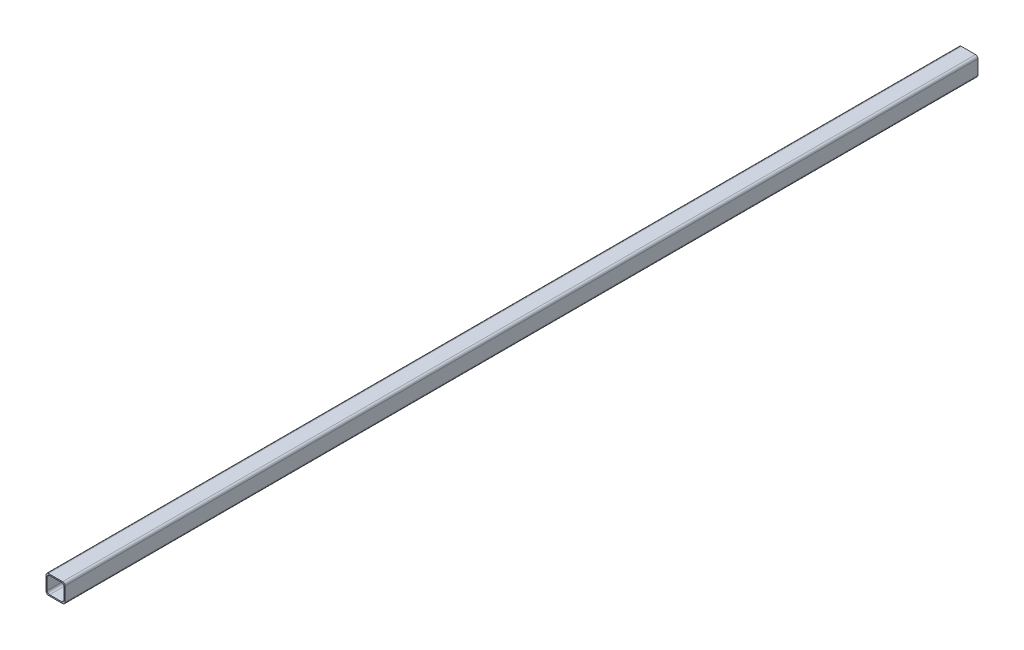
ISO-10303-21;
HEADER;
FILE_DESCRIPTION(('STEP AP214'),'2;1');
FILE_NAME('part.step','',(''),(''),'','','');
FILE_SCHEMA(('AUTOMOTIVE_DESIGN { 1 0 10303 214 1 1 1 1 }'));
ENDSEC;
DATA;
#1=APPLICATION_CONTEXT('core data for automotive mechanical design processes');
#2=APPLICATION_PROTOCOL_DEFINITION('international standard','automotive_design',2000,#1);
#3=PRODUCT_CONTEXT('',#1,'mechanical');
#4=PRODUCT('Part','Part','',(#3));
#5=PRODUCT_RELATED_PRODUCT_CATEGORY('part','',(#4));
#6=PRODUCT_DEFINITION_FORMATION('','',#4);
#7=PRODUCT_DEFINITION_CONTEXT('part definition',#1,'design');
#8=PRODUCT_DEFINITION('design','',#6,#7);
#9=PRODUCT_DEFINITION_SHAPE('','',#8);
#10=(LENGTH_UNIT() NAMED_UNIT(*) SI_UNIT(.MILLI.,.METRE.));
#11=(NAMED_UNIT(*) PLANE_ANGLE_UNIT() SI_UNIT($,.RADIAN.));
#12=(NAMED_UNIT(*) SI_UNIT($,.STERADIAN.) SOLID_ANGLE_UNIT());
#13=UNCERTAINTY_MEASURE_WITH_UNIT(LENGTH_MEASURE(1.E-05),#10,'distance_accuracy_value','');
#14=(GEOMETRIC_REPRESENTATION_CONTEXT(3) GLOBAL_UNCERTAINTY_ASSIGNED_CONTEXT((#13)) GLOBAL_UNIT_ASSIGNED_CONTEXT((#10,
#11,#12)) REPRESENTATION_CONTEXT('',''));
#15=CARTESIAN_POINT('',(0.,0.,0.));
#16=DIRECTION('',(0.,0.,1.));
#17=DIRECTION('',(1.,0.,0.));
#18=AXIS2_PLACEMENT_3D('',#15,#16,#17);
#19=CARTESIAN_POINT('',(0.,0.,609.6));
#20=DIRECTION('',(0.,0.,1.));
#21=DIRECTION('',(1.,0.,0.));
#22=AXIS2_PLACEMENT_3D('',#19,#20,#21);
#23=PLANE('',#22);
#24=DIRECTION('',(1.,0.,0.));
#25=VECTOR('',#24,1.);
#26=CARTESIAN_POINT('',(-12.7,-12.7,609.6));
#27=LINE('',#26,#25);
#28=CARTESIAN_POINT('',(-9.525,-12.7,609.6));
#29=VERTEX_POINT('',#28);
#30=CARTESIAN_POINT('',(9.525,-12.7,609.6));
#31=VERTEX_POINT('',#30);
#32=EDGE_CURVE('E170',#29,#31,#27,.T.);
#33=ORIENTED_EDGE('',*,*,#32,.T.);
#34=CARTESIAN_POINT('',(9.525,-9.525,609.6));
#35=DIRECTION('',(0.,0.,1.));
#36=DIRECTION('',(1.,0.,0.));
#37=AXIS2_PLACEMENT_3D('',#34,#35,#36);
#38=CIRCLE('',#37,3.175);
#39=CARTESIAN_POINT('',(12.7,-9.525,609.6));
#40=VERTEX_POINT('',#39);
#41=EDGE_CURVE('E213',#31,#40,#38,.T.);
#42=ORIENTED_EDGE('',*,*,#41,.T.);
#43=DIRECTION('',(0.,1.,0.));
#44=VECTOR('',#43,1.);
#45=CARTESIAN_POINT('',(12.7,12.7,609.6));
#46=LINE('',#45,#44);
#47=CARTESIAN_POINT('',(12.7,9.525,609.6));
#48=VERTEX_POINT('',#47);
#49=EDGE_CURVE('E262',#40,#48,#46,.T.);
#50=ORIENTED_EDGE('',*,*,#49,.T.);
#51=CARTESIAN_POINT('',(9.525,9.525,609.6));
#52=DIRECTION('',(0.,0.,1.));
#53=DIRECTION('',(1.,0.,0.));
#54=AXIS2_PLACEMENT_3D('',#51,#52,#53);
#55=CIRCLE('',#54,3.175);
#56=CARTESIAN_POINT('',(9.525,12.7,609.6));
#57=VERTEX_POINT('',#56);
#58=EDGE_CURVE('E207',#48,#57,#55,.T.);
#59=ORIENTED_EDGE('',*,*,#58,.T.);
#60=DIRECTION('',(-1.,0.,0.));
#61=VECTOR('',#60,1.);
#62=CARTESIAN_POINT('',(-12.7,12.7,609.6));
#63=LINE('',#62,#61);
#64=CARTESIAN_POINT('',(-9.525,12.7,609.6));
#65=VERTEX_POINT('',#64);
#66=EDGE_CURVE('E265',#57,#65,#63,.T.);
#67=ORIENTED_EDGE('',*,*,#66,.T.);
#68=CARTESIAN_POINT('',(-9.525,9.525,609.6));
#69=DIRECTION('',(0.,0.,1.));
#70=DIRECTION('',(1.,0.,0.));
#71=AXIS2_PLACEMENT_3D('',#68,#69,#70);
#72=CIRCLE('',#71,3.175);
#73=CARTESIAN_POINT('',(-12.7,9.525,609.6));
#74=VERTEX_POINT('',#73);
#75=EDGE_CURVE('E209',#65,#74,#72,.T.);
#76=ORIENTED_EDGE('',*,*,#75,.T.);
#77=DIRECTION('',(0.,-1.,0.));
#78=VECTOR('',#77,1.);
#79=CARTESIAN_POINT('',(-12.7,12.7,609.6));
#80=LINE('',#79,#78);
#81=CARTESIAN_POINT('',(-12.7,-9.525,609.6));
#82=VERTEX_POINT('',#81);
#83=EDGE_CURVE('E175',#74,#82,#80,.T.);
#84=ORIENTED_EDGE('',*,*,#83,.T.);
#85=CARTESIAN_POINT('',(-9.525,-9.525,609.6));
#86=DIRECTION('',(0.,0.,1.));
#87=DIRECTION('',(1.,0.,0.));
#88=AXIS2_PLACEMENT_3D('',#85,#86,#87);
#89=CIRCLE('',#88,3.175);
#90=EDGE_CURVE('E211',#82,#29,#89,.T.);
#91=ORIENTED_EDGE('',*,*,#90,.T.);
#92=EDGE_LOOP('',(#33,#42,#50,#59,#67,#76,#84,#91));
#93=FACE_BOUND('',#92,.T.);
#94=DIRECTION('',(-1.,0.,0.));
#95=VECTOR('',#94,1.);
#96=CARTESIAN_POINT('',(-11.1252,11.1252,609.6));
#97=LINE('',#96,#95);
#98=CARTESIAN_POINT('',(7.95019999999999,11.1252,609.6));
#99=VERTEX_POINT('',#98);
#100=CARTESIAN_POINT('',(-7.9502,11.1252,609.6));
#101=VERTEX_POINT('',#100);
#102=EDGE_CURVE('E247',#99,#101,#97,.T.);
#103=ORIENTED_EDGE('',*,*,#102,.F.);
#104=CARTESIAN_POINT('',(7.9502,7.9502,609.6));
#105=DIRECTION('',(0.,0.,1.));
#106=DIRECTION('',(1.,0.,0.));
#107=AXIS2_PLACEMENT_3D('',#104,#105,#106);
#108=CIRCLE('',#107,3.175);
#109=CARTESIAN_POINT('',(11.1252,7.9502,609.6));
#110=VERTEX_POINT('',#109);
#111=EDGE_CURVE('E235',#99,#110,#108,.F.);
#112=ORIENTED_EDGE('',*,*,#111,.T.);
#113=DIRECTION('',(0.,1.,0.));
#114=VECTOR('',#113,1.);
#115=CARTESIAN_POINT('',(11.1252,11.1252,609.6));
#116=LINE('',#115,#114);
#117=CARTESIAN_POINT('',(11.1252,-7.95019999999999,609.6));
#118=VERTEX_POINT('',#117);
#119=EDGE_CURVE('E166',#118,#110,#116,.T.);
#120=ORIENTED_EDGE('',*,*,#119,.F.);
#121=CARTESIAN_POINT('',(7.9502,-7.9502,609.6));
#122=DIRECTION('',(0.,0.,1.));
#123=DIRECTION('',(1.,0.,0.));
#124=AXIS2_PLACEMENT_3D('',#121,#122,#123);
#125=CIRCLE('',#124,3.175);
#126=CARTESIAN_POINT('',(7.9502,-11.1252,609.6));
#127=VERTEX_POINT('',#126);
#128=EDGE_CURVE('E156',#118,#127,#125,.F.);
#129=ORIENTED_EDGE('',*,*,#128,.T.);
#130=DIRECTION('',(1.,0.,0.));
#131=VECTOR('',#130,1.);
#132=CARTESIAN_POINT('',(-11.1252,-11.1252,609.6));
#133=LINE('',#132,#131);
#134=CARTESIAN_POINT('',(-7.9502,-11.1252,609.6));
#135=VERTEX_POINT('',#134);
#136=EDGE_CURVE('E251',#135,#127,#133,.T.);
#137=ORIENTED_EDGE('',*,*,#136,.F.);
#138=CARTESIAN_POINT('',(-7.9502,-7.9502,609.6));
#139=DIRECTION('',(0.,0.,1.));
#140=DIRECTION('',(1.,0.,0.));
#141=AXIS2_PLACEMENT_3D('',#138,#139,#140);
#142=CIRCLE('',#141,3.175);
#143=CARTESIAN_POINT('',(-11.1252,-7.95019999999999,609.6));
#144=VERTEX_POINT('',#143);
#145=EDGE_CURVE('E155',#135,#144,#142,.F.);
#146=ORIENTED_EDGE('',*,*,#145,.T.);
#147=DIRECTION('',(0.,-1.,0.));
#148=VECTOR('',#147,1.);
#149=CARTESIAN_POINT('',(-11.1252,11.1252,609.6));
#150=LINE('',#149,#148);
#151=CARTESIAN_POINT('',(-11.1252,7.9502,609.6));
#152=VERTEX_POINT('',#151);
#153=EDGE_CURVE('E249',#152,#144,#150,.T.);
#154=ORIENTED_EDGE('',*,*,#153,.F.);
#155=CARTESIAN_POINT('',(-7.9502,7.9502,609.6));
#156=DIRECTION('',(0.,0.,1.));
#157=DIRECTION('',(1.,0.,0.));
#158=AXIS2_PLACEMENT_3D('',#155,#156,#157);
#159=CIRCLE('',#158,3.175);
#160=EDGE_CURVE('E11',#152,#101,#159,.F.);
#161=ORIENTED_EDGE('',*,*,#160,.T.);
#162=EDGE_LOOP('',(#103,#112,#120,#129,#137,#146,#154,#161));
#163=FACE_BOUND('',#162,.T.);
#164=ADVANCED_FACE('F32',(#93,#163),#23,.T.);
#165=CARTESIAN_POINT('',(0.,0.,-609.6));
#166=DIRECTION('',(0.,0.,1.));
#167=DIRECTION('',(1.,0.,0.));
#168=AXIS2_PLACEMENT_3D('',#165,#166,#167);
#169=PLANE('',#168);
#170=DIRECTION('',(0.,1.,0.));
#171=VECTOR('',#170,1.);
#172=CARTESIAN_POINT('',(12.7,12.7,-609.6));
#173=LINE('',#172,#171);
#174=CARTESIAN_POINT('',(12.7,-9.525,-609.6));
#175=VERTEX_POINT('',#174);
#176=CARTESIAN_POINT('',(12.7,9.525,-609.6));
#177=VERTEX_POINT('',#176);
#178=EDGE_CURVE('E257',#175,#177,#173,.T.);
#179=ORIENTED_EDGE('',*,*,#178,.F.);
#180=CARTESIAN_POINT('',(9.525,-9.525,-609.6));
#181=DIRECTION('',(0.,0.,1.));
#182=DIRECTION('',(1.,0.,0.));
#183=AXIS2_PLACEMENT_3D('',#180,#181,#182);
#184=CIRCLE('',#183,3.175);
#185=CARTESIAN_POINT('',(9.525,-12.7,-609.6));
#186=VERTEX_POINT('',#185);
#187=EDGE_CURVE('E200',#175,#186,#184,.F.);
#188=ORIENTED_EDGE('',*,*,#187,.T.);
#189=DIRECTION('',(1.,0.,0.));
#190=VECTOR('',#189,1.);
#191=CARTESIAN_POINT('',(-12.7,-12.7,-609.6));
#192=LINE('',#191,#190);
#193=CARTESIAN_POINT('',(-9.525,-12.7,-609.6));
#194=VERTEX_POINT('',#193);
#195=EDGE_CURVE('E178',#194,#186,#192,.T.);
#196=ORIENTED_EDGE('',*,*,#195,.F.);
#197=CARTESIAN_POINT('',(-9.525,-9.525,-609.6));
#198=DIRECTION('',(0.,0.,1.));
#199=DIRECTION('',(1.,0.,0.));
#200=AXIS2_PLACEMENT_3D('',#197,#198,#199);
#201=CIRCLE('',#200,3.175);
#202=CARTESIAN_POINT('',(-12.7,-9.525,-609.6));
#203=VERTEX_POINT('',#202);
#204=EDGE_CURVE('E198',#194,#203,#201,.F.);
#205=ORIENTED_EDGE('',*,*,#204,.T.);
#206=DIRECTION('',(0.,-1.,0.));
#207=VECTOR('',#206,1.);
#208=CARTESIAN_POINT('',(-12.7,12.7,-609.6));
#209=LINE('',#208,#207);
#210=CARTESIAN_POINT('',(-12.7,9.525,-609.6));
#211=VERTEX_POINT('',#210);
#212=EDGE_CURVE('E274',#211,#203,#209,.T.);
#213=ORIENTED_EDGE('',*,*,#212,.F.);
#214=CARTESIAN_POINT('',(-9.525,9.525,-609.6));
#215=DIRECTION('',(0.,0.,1.));
#216=DIRECTION('',(1.,0.,0.));
#217=AXIS2_PLACEMENT_3D('',#214,#215,#216);
#218=CIRCLE('',#217,3.175);
#219=CARTESIAN_POINT('',(-9.525,12.7,-609.6));
#220=VERTEX_POINT('',#219);
#221=EDGE_CURVE('E196',#211,#220,#218,.F.);
#222=ORIENTED_EDGE('',*,*,#221,.T.);
#223=DIRECTION('',(-1.,0.,0.));
#224=VECTOR('',#223,1.);
#225=CARTESIAN_POINT('',(-12.7,12.7,-609.6));
#226=LINE('',#225,#224);
#227=CARTESIAN_POINT('',(9.525,12.7,-609.6));
#228=VERTEX_POINT('',#227);
#229=EDGE_CURVE('E272',#228,#220,#226,.T.);
#230=ORIENTED_EDGE('',*,*,#229,.F.);
#231=CARTESIAN_POINT('',(9.525,9.525,-609.6));
#232=DIRECTION('',(0.,0.,1.));
#233=DIRECTION('',(1.,0.,0.));
#234=AXIS2_PLACEMENT_3D('',#231,#232,#233);
#235=CIRCLE('',#234,3.175);
#236=EDGE_CURVE('E194',#228,#177,#235,.F.);
#237=ORIENTED_EDGE('',*,*,#236,.T.);
#238=EDGE_LOOP('',(#179,#188,#196,#205,#213,#222,#230,#237));
#239=FACE_BOUND('',#238,.T.);
#240=DIRECTION('',(1.,0.,0.));
#241=VECTOR('',#240,1.);
#242=CARTESIAN_POINT('',(-11.1252,-11.1252,-609.6));
#243=LINE('',#242,#241);
#244=CARTESIAN_POINT('',(-7.9502,-11.1252,-609.6));
#245=VERTEX_POINT('',#244);
#246=CARTESIAN_POINT('',(7.9502,-11.1252,-609.6));
#247=VERTEX_POINT('',#246);
#248=EDGE_CURVE('E148',#245,#247,#243,.T.);
#249=ORIENTED_EDGE('',*,*,#248,.T.);
#250=CARTESIAN_POINT('',(7.9502,-7.9502,-609.6));
#251=DIRECTION('',(0.,0.,1.));
#252=DIRECTION('',(1.,0.,0.));
#253=AXIS2_PLACEMENT_3D('',#250,#251,#252);
#254=CIRCLE('',#253,3.175);
#255=CARTESIAN_POINT('',(11.1252,-7.95019999999999,-609.6));
#256=VERTEX_POINT('',#255);
#257=EDGE_CURVE('E229',#247,#256,#254,.T.);
#258=ORIENTED_EDGE('',*,*,#257,.T.);
#259=DIRECTION('',(0.,1.,0.));
#260=VECTOR('',#259,1.);
#261=CARTESIAN_POINT('',(11.1252,11.1252,-609.6));
#262=LINE('',#261,#260);
#263=CARTESIAN_POINT('',(11.1252,7.9502,-609.6));
#264=VERTEX_POINT('',#263);
#265=EDGE_CURVE('E258',#256,#264,#262,.T.);
#266=ORIENTED_EDGE('',*,*,#265,.T.);
#267=CARTESIAN_POINT('',(7.9502,7.9502,-609.6));
#268=DIRECTION('',(0.,0.,1.));
#269=DIRECTION('',(1.,0.,0.));
#270=AXIS2_PLACEMENT_3D('',#267,#268,#269);
#271=CIRCLE('',#270,3.175);
#272=CARTESIAN_POINT('',(7.95019999999999,11.1252,-609.6));
#273=VERTEX_POINT('',#272);
#274=EDGE_CURVE('E233',#264,#273,#271,.T.);
#275=ORIENTED_EDGE('',*,*,#274,.T.);
#276=DIRECTION('',(-1.,0.,0.));
#277=VECTOR('',#276,1.);
#278=CARTESIAN_POINT('',(-11.1252,11.1252,-609.6));
#279=LINE('',#278,#277);
#280=CARTESIAN_POINT('',(-7.9502,11.1252,-609.6));
#281=VERTEX_POINT('',#280);
#282=EDGE_CURVE('E237',#273,#281,#279,.T.);
#283=ORIENTED_EDGE('',*,*,#282,.T.);
#284=CARTESIAN_POINT('',(-7.9502,7.9502,-609.6));
#285=DIRECTION('',(0.,0.,1.));
#286=DIRECTION('',(1.,0.,0.));
#287=AXIS2_PLACEMENT_3D('',#284,#285,#286);
#288=CIRCLE('',#287,3.175);
#289=CARTESIAN_POINT('',(-11.1252,7.9502,-609.6));
#290=VERTEX_POINT('',#289);
#291=EDGE_CURVE('E40',#281,#290,#288,.T.);
#292=ORIENTED_EDGE('',*,*,#291,.T.);
#293=DIRECTION('',(0.,-1.,0.));
#294=VECTOR('',#293,1.);
#295=CARTESIAN_POINT('',(-11.1252,11.1252,-609.6));
#296=LINE('',#295,#294);
#297=CARTESIAN_POINT('',(-11.1252,-7.95019999999999,-609.6));
#298=VERTEX_POINT('',#297);
#299=EDGE_CURVE('E150',#290,#298,#296,.T.);
#300=ORIENTED_EDGE('',*,*,#299,.T.);
#301=CARTESIAN_POINT('',(-7.9502,-7.9502,-609.6));
#302=DIRECTION('',(0.,0.,1.));
#303=DIRECTION('',(1.,0.,0.));
#304=AXIS2_PLACEMENT_3D('',#301,#302,#303);
#305=CIRCLE('',#304,3.175);
#306=EDGE_CURVE('E145',#298,#245,#305,.T.);
#307=ORIENTED_EDGE('',*,*,#306,.T.);
#308=EDGE_LOOP('',(#249,#258,#266,#275,#283,#292,#300,#307));
#309=FACE_BOUND('',#308,.T.);
#310=ADVANCED_FACE('F147',(#239,#309),#169,.F.);
#311=CARTESIAN_POINT('',(12.7,12.7,609.6));
#312=DIRECTION('',(-1.,0.,0.));
#313=DIRECTION('',(0.,-1.,0.));
#314=AXIS2_PLACEMENT_3D('',#311,#312,#313);
#315=PLANE('',#314);
#316=ORIENTED_EDGE('',*,*,#49,.F.);
#317=DIRECTION('',(0.,0.,-1.));
#318=VECTOR('',#317,1.);
#319=CARTESIAN_POINT('',(12.7,-9.525,609.6));
#320=LINE('',#319,#318);
#321=EDGE_CURVE('E191',#40,#175,#320,.T.);
#322=ORIENTED_EDGE('',*,*,#321,.T.);
#323=ORIENTED_EDGE('',*,*,#178,.T.);
#324=DIRECTION('',(0.,0.,-1.));
#325=VECTOR('',#324,1.);
#326=CARTESIAN_POINT('',(12.7,9.525,609.6));
#327=LINE('',#326,#325);
#328=EDGE_CURVE('E189',#177,#48,#327,.F.);
#329=ORIENTED_EDGE('',*,*,#328,.T.);
#330=EDGE_LOOP('',(#316,#322,#323,#329));
#331=FACE_BOUND('',#330,.T.);
#332=ADVANCED_FACE('F295',(#331),#315,.F.);
#333=CARTESIAN_POINT('',(-12.7,12.7,609.6));
#334=DIRECTION('',(0.,-1.,0.));
#335=DIRECTION('',(0.,0.,-1.));
#336=AXIS2_PLACEMENT_3D('',#333,#334,#335);
#337=PLANE('',#336);
#338=ORIENTED_EDGE('',*,*,#229,.T.);
#339=DIRECTION('',(0.,0.,-1.));
#340=VECTOR('',#339,1.);
#341=CARTESIAN_POINT('',(-9.525,12.7,609.6));
#342=LINE('',#341,#340);
#343=EDGE_CURVE('E227',#220,#65,#342,.F.);
#344=ORIENTED_EDGE('',*,*,#343,.T.);
#345=ORIENTED_EDGE('',*,*,#66,.F.);
#346=DIRECTION('',(0.,0.,-1.));
#347=VECTOR('',#346,1.);
#348=CARTESIAN_POINT('',(9.525,12.7,609.6));
#349=LINE('',#348,#347);
#350=EDGE_CURVE('E224',#57,#228,#349,.T.);
#351=ORIENTED_EDGE('',*,*,#350,.T.);
#352=EDGE_LOOP('',(#338,#344,#345,#351));
#353=FACE_BOUND('',#352,.T.);
#354=ADVANCED_FACE('F303',(#353),#337,.F.);
#355=CARTESIAN_POINT('',(-12.7,12.7,609.6));
#356=DIRECTION('',(1.,0.,0.));
#357=DIRECTION('',(0.,1.,0.));
#358=AXIS2_PLACEMENT_3D('',#355,#356,#357);
#359=PLANE('',#358);
#360=ORIENTED_EDGE('',*,*,#212,.T.);
#361=DIRECTION('',(0.,0.,-1.));
#362=VECTOR('',#361,1.);
#363=CARTESIAN_POINT('',(-12.7,-9.525,609.6));
#364=LINE('',#363,#362);
#365=EDGE_CURVE('E218',#203,#82,#364,.F.);
#366=ORIENTED_EDGE('',*,*,#365,.T.);
#367=ORIENTED_EDGE('',*,*,#83,.F.);
#368=DIRECTION('',(0.,0.,-1.));
#369=VECTOR('',#368,1.);
#370=CARTESIAN_POINT('',(-12.7,9.525,609.6));
#371=LINE('',#370,#369);
#372=EDGE_CURVE('E215',#74,#211,#371,.T.);
#373=ORIENTED_EDGE('',*,*,#372,.T.);
#374=EDGE_LOOP('',(#360,#366,#367,#373));
#375=FACE_BOUND('',#374,.T.);
#376=ADVANCED_FACE('F311',(#375),#359,.F.);
#377=CARTESIAN_POINT('',(-12.7,-12.7,609.6));
#378=DIRECTION('',(0.,1.,0.));
#379=DIRECTION('',(0.,0.,1.));
#380=AXIS2_PLACEMENT_3D('',#377,#378,#379);
#381=PLANE('',#380);
#382=ORIENTED_EDGE('',*,*,#195,.T.);
#383=DIRECTION('',(0.,0.,-1.));
#384=VECTOR('',#383,1.);
#385=CARTESIAN_POINT('',(9.525,-12.7,609.6));
#386=LINE('',#385,#384);
#387=EDGE_CURVE('E205',#186,#31,#386,.F.);
#388=ORIENTED_EDGE('',*,*,#387,.T.);
#389=ORIENTED_EDGE('',*,*,#32,.F.);
#390=DIRECTION('',(0.,0.,-1.));
#391=VECTOR('',#390,1.);
#392=CARTESIAN_POINT('',(-9.525,-12.7,609.6));
#393=LINE('',#392,#391);
#394=EDGE_CURVE('E202',#29,#194,#393,.T.);
#395=ORIENTED_EDGE('',*,*,#394,.T.);
#396=EDGE_LOOP('',(#382,#388,#389,#395));
#397=FACE_BOUND('',#396,.T.);
#398=ADVANCED_FACE('F283',(#397),#381,.F.);
#399=CARTESIAN_POINT('',(11.1252,11.1252,609.6));
#400=DIRECTION('',(-1.,0.,0.));
#401=DIRECTION('',(0.,-1.,0.));
#402=AXIS2_PLACEMENT_3D('',#399,#400,#401);
#403=PLANE('',#402);
#404=ORIENTED_EDGE('',*,*,#265,.F.);
#405=DIRECTION('',(0.,0.,-1.));
#406=VECTOR('',#405,1.);
#407=CARTESIAN_POINT('',(11.1252,-7.9502,609.6));
#408=LINE('',#407,#406);
#409=EDGE_CURVE('E183',#256,#118,#408,.F.);
#410=ORIENTED_EDGE('',*,*,#409,.T.);
#411=ORIENTED_EDGE('',*,*,#119,.T.);
#412=DIRECTION('',(0.,0.,-1.));
#413=VECTOR('',#412,1.);
#414=CARTESIAN_POINT('',(11.1252,7.9502,-609.6));
#415=LINE('',#414,#413);
#416=EDGE_CURVE('E172',#110,#264,#415,.T.);
#417=ORIENTED_EDGE('',*,*,#416,.T.);
#418=EDGE_LOOP('',(#404,#410,#411,#417));
#419=FACE_BOUND('',#418,.T.);
#420=ADVANCED_FACE('F326',(#419),#403,.T.);
#421=CARTESIAN_POINT('',(-11.1252,11.1252,609.6));
#422=DIRECTION('',(0.,-1.,0.));
#423=DIRECTION('',(0.,0.,-1.));
#424=AXIS2_PLACEMENT_3D('',#421,#422,#423);
#425=PLANE('',#424);
#426=ORIENTED_EDGE('',*,*,#282,.F.);
#427=DIRECTION('',(0.,0.,-1.));
#428=VECTOR('',#427,1.);
#429=CARTESIAN_POINT('',(7.9502,11.1252,609.6));
#430=LINE('',#429,#428);
#431=EDGE_CURVE('E52',#273,#99,#430,.F.);
#432=ORIENTED_EDGE('',*,*,#431,.T.);
#433=ORIENTED_EDGE('',*,*,#102,.T.);
#434=DIRECTION('',(0.,0.,-1.));
#435=VECTOR('',#434,1.);
#436=CARTESIAN_POINT('',(-7.9502,11.1252,-609.6));
#437=LINE('',#436,#435);
#438=EDGE_CURVE('E220',#101,#281,#437,.T.);
#439=ORIENTED_EDGE('',*,*,#438,.T.);
#440=EDGE_LOOP('',(#426,#432,#433,#439));
#441=FACE_BOUND('',#440,.T.);
#442=ADVANCED_FACE('F246',(#441),#425,.T.);
#443=CARTESIAN_POINT('',(-11.1252,11.1252,609.6));
#444=DIRECTION('',(1.,0.,0.));
#445=DIRECTION('',(0.,0.,-1.));
#446=AXIS2_PLACEMENT_3D('',#443,#444,#445);
#447=PLANE('',#446);
#448=ORIENTED_EDGE('',*,*,#153,.T.);
#449=DIRECTION('',(0.,0.,-1.));
#450=VECTOR('',#449,1.);
#451=CARTESIAN_POINT('',(-11.1252,-7.9502,-609.6));
#452=LINE('',#451,#450);
#453=EDGE_CURVE('E187',#144,#298,#452,.T.);
#454=ORIENTED_EDGE('',*,*,#453,.T.);
#455=ORIENTED_EDGE('',*,*,#299,.F.);
#456=DIRECTION('',(0.,0.,-1.));
#457=VECTOR('',#456,1.);
#458=CARTESIAN_POINT('',(-11.1252,7.9502,609.6));
#459=LINE('',#458,#457);
#460=EDGE_CURVE('E185',#290,#152,#459,.F.);
#461=ORIENTED_EDGE('',*,*,#460,.T.);
#462=EDGE_LOOP('',(#448,#454,#455,#461));
#463=FACE_BOUND('',#462,.T.);
#464=ADVANCED_FACE('F243',(#463),#447,.T.);
#465=CARTESIAN_POINT('',(-11.1252,-11.1252,609.6));
#466=DIRECTION('',(0.,1.,0.));
#467=DIRECTION('',(0.,0.,1.));
#468=AXIS2_PLACEMENT_3D('',#465,#466,#467);
#469=PLANE('',#468);
#470=ORIENTED_EDGE('',*,*,#136,.T.);
#471=DIRECTION('',(0.,0.,-1.));
#472=VECTOR('',#471,1.);
#473=CARTESIAN_POINT('',(7.9502,-11.1252,-609.6));
#474=LINE('',#473,#472);
#475=EDGE_CURVE('E165',#127,#247,#474,.T.);
#476=ORIENTED_EDGE('',*,*,#475,.T.);
#477=ORIENTED_EDGE('',*,*,#248,.F.);
#478=DIRECTION('',(0.,0.,-1.));
#479=VECTOR('',#478,1.);
#480=CARTESIAN_POINT('',(-7.9502,-11.1252,609.6));
#481=LINE('',#480,#479);
#482=EDGE_CURVE('E162',#245,#135,#481,.F.);
#483=ORIENTED_EDGE('',*,*,#482,.T.);
#484=EDGE_LOOP('',(#470,#476,#477,#483));
#485=FACE_BOUND('',#484,.T.);
#486=ADVANCED_FACE('F161',(#485),#469,.T.);
#487=CARTESIAN_POINT('',(7.9502,-7.9502,609.6));
#488=DIRECTION('',(0.,0.,1.));
#489=DIRECTION('',(1.,0.,0.));
#490=AXIS2_PLACEMENT_3D('',#487,#488,#489);
#491=CYLINDRICAL_SURFACE('',#490,3.175);
#492=ORIENTED_EDGE('',*,*,#128,.F.);
#493=ORIENTED_EDGE('',*,*,#409,.F.);
#494=ORIENTED_EDGE('',*,*,#257,.F.);
#495=ORIENTED_EDGE('',*,*,#475,.F.);
#496=EDGE_LOOP('',(#492,#493,#494,#495));
#497=FACE_BOUND('',#496,.T.);
#498=ADVANCED_FACE('F331',(#497),#491,.F.);
#499=CARTESIAN_POINT('',(-7.9502,-7.9502,609.6));
#500=DIRECTION('',(0.,0.,1.));
#501=DIRECTION('',(1.,0.,0.));
#502=AXIS2_PLACEMENT_3D('',#499,#500,#501);
#503=CYLINDRICAL_SURFACE('',#502,3.175);
#504=ORIENTED_EDGE('',*,*,#145,.F.);
#505=ORIENTED_EDGE('',*,*,#482,.F.);
#506=ORIENTED_EDGE('',*,*,#306,.F.);
#507=ORIENTED_EDGE('',*,*,#453,.F.);
#508=EDGE_LOOP('',(#504,#505,#506,#507));
#509=FACE_BOUND('',#508,.T.);
#510=ADVANCED_FACE('F169',(#509),#503,.F.);
#511=CARTESIAN_POINT('',(9.525,-9.525,609.6));
#512=DIRECTION('',(0.,0.,-1.));
#513=DIRECTION('',(-1.,0.,0.));
#514=AXIS2_PLACEMENT_3D('',#511,#512,#513);
#515=CYLINDRICAL_SURFACE('',#514,3.175);
#516=ORIENTED_EDGE('',*,*,#41,.F.);
#517=ORIENTED_EDGE('',*,*,#387,.F.);
#518=ORIENTED_EDGE('',*,*,#187,.F.);
#519=ORIENTED_EDGE('',*,*,#321,.F.);
#520=EDGE_LOOP('',(#516,#517,#518,#519));
#521=FACE_BOUND('',#520,.T.);
#522=ADVANCED_FACE('F289',(#521),#515,.T.);
#523=CARTESIAN_POINT('',(-9.525,-9.525,609.6));
#524=DIRECTION('',(0.,0.,-1.));
#525=DIRECTION('',(-1.,0.,0.));
#526=AXIS2_PLACEMENT_3D('',#523,#524,#525);
#527=CYLINDRICAL_SURFACE('',#526,3.175);
#528=ORIENTED_EDGE('',*,*,#90,.F.);
#529=ORIENTED_EDGE('',*,*,#365,.F.);
#530=ORIENTED_EDGE('',*,*,#204,.F.);
#531=ORIENTED_EDGE('',*,*,#394,.F.);
#532=EDGE_LOOP('',(#528,#529,#530,#531));
#533=FACE_BOUND('',#532,.T.);
#534=ADVANCED_FACE('F313',(#533),#527,.T.);
#535=CARTESIAN_POINT('',(7.9502,7.9502,609.6));
#536=DIRECTION('',(0.,0.,1.));
#537=DIRECTION('',(1.,0.,0.));
#538=AXIS2_PLACEMENT_3D('',#535,#536,#537);
#539=CYLINDRICAL_SURFACE('',#538,3.175);
#540=ORIENTED_EDGE('',*,*,#111,.F.);
#541=ORIENTED_EDGE('',*,*,#431,.F.);
#542=ORIENTED_EDGE('',*,*,#274,.F.);
#543=ORIENTED_EDGE('',*,*,#416,.F.);
#544=EDGE_LOOP('',(#540,#541,#542,#543));
#545=FACE_BOUND('',#544,.T.);
#546=ADVANCED_FACE('F341',(#545),#539,.F.);
#547=CARTESIAN_POINT('',(-7.9502,7.9502,609.6));
#548=DIRECTION('',(0.,0.,1.));
#549=DIRECTION('',(1.,0.,0.));
#550=AXIS2_PLACEMENT_3D('',#547,#548,#549);
#551=CYLINDRICAL_SURFACE('',#550,3.175);
#552=ORIENTED_EDGE('',*,*,#160,.F.);
#553=ORIENTED_EDGE('',*,*,#460,.F.);
#554=ORIENTED_EDGE('',*,*,#291,.F.);
#555=ORIENTED_EDGE('',*,*,#438,.F.);
#556=EDGE_LOOP('',(#552,#553,#554,#555));
#557=FACE_BOUND('',#556,.T.);
#558=ADVANCED_FACE('F245',(#557),#551,.F.);
#559=CARTESIAN_POINT('',(-9.525,9.525,609.6));
#560=DIRECTION('',(0.,0.,-1.));
#561=DIRECTION('',(-1.,0.,0.));
#562=AXIS2_PLACEMENT_3D('',#559,#560,#561);
#563=CYLINDRICAL_SURFACE('',#562,3.175);
#564=ORIENTED_EDGE('',*,*,#75,.F.);
#565=ORIENTED_EDGE('',*,*,#343,.F.);
#566=ORIENTED_EDGE('',*,*,#221,.F.);
#567=ORIENTED_EDGE('',*,*,#372,.F.);
#568=EDGE_LOOP('',(#564,#565,#566,#567));
#569=FACE_BOUND('',#568,.T.);
#570=ADVANCED_FACE('F307',(#569),#563,.T.);
#571=CARTESIAN_POINT('',(9.525,9.525,609.6));
#572=DIRECTION('',(0.,0.,-1.));
#573=DIRECTION('',(-1.,0.,0.));
#574=AXIS2_PLACEMENT_3D('',#571,#572,#573);
#575=CYLINDRICAL_SURFACE('',#574,3.175);
#576=ORIENTED_EDGE('',*,*,#58,.F.);
#577=ORIENTED_EDGE('',*,*,#328,.F.);
#578=ORIENTED_EDGE('',*,*,#236,.F.);
#579=ORIENTED_EDGE('',*,*,#350,.F.);
#580=EDGE_LOOP('',(#576,#577,#578,#579));
#581=FACE_BOUND('',#580,.T.);
#582=ADVANCED_FACE('F34',(#581),#575,.T.);
#583=CLOSED_SHELL('',(#164,#310,#332,#354,#376,#398,#420,#442,#464,#486,#498,#510,#522,#534,
#546,#558,#570,#582));
#584=MANIFOLD_SOLID_BREP('B2',#583);
#585=ADVANCED_BREP_SHAPE_REPRESENTATION('',(#18,#584),#14);
#586=SHAPE_DEFINITION_REPRESENTATION(#9,#585);
ENDSEC;
END-ISO-10303-21;
